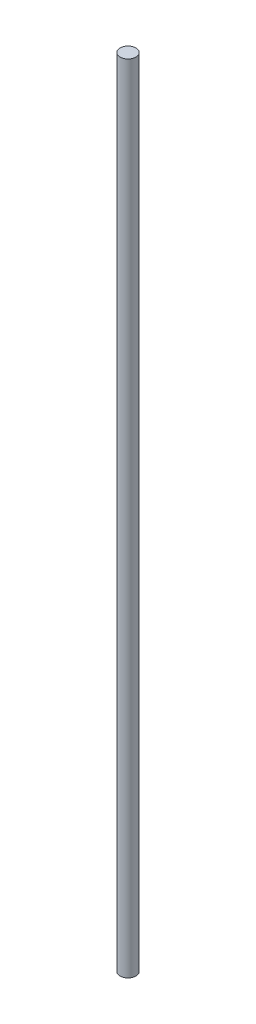
ISO-10303-21;
HEADER;
FILE_DESCRIPTION(('STEP AP214'),'2;1');
FILE_NAME('part.step','',(''),(''),'','','');
FILE_SCHEMA(('AUTOMOTIVE_DESIGN { 1 0 10303 214 1 1 1 1 }'));
ENDSEC;
DATA;
#1=APPLICATION_CONTEXT('core data for automotive mechanical design processes');
#2=APPLICATION_PROTOCOL_DEFINITION('international standard','automotive_design',2000,#1);
#3=PRODUCT_CONTEXT('',#1,'mechanical');
#4=PRODUCT('Part','Part','',(#3));
#5=PRODUCT_RELATED_PRODUCT_CATEGORY('part','',(#4));
#6=PRODUCT_DEFINITION_FORMATION('','',#4);
#7=PRODUCT_DEFINITION_CONTEXT('part definition',#1,'design');
#8=PRODUCT_DEFINITION('design','',#6,#7);
#9=PRODUCT_DEFINITION_SHAPE('','',#8);
#10=(LENGTH_UNIT() NAMED_UNIT(*) SI_UNIT(.MILLI.,.METRE.));
#11=(NAMED_UNIT(*) PLANE_ANGLE_UNIT() SI_UNIT($,.RADIAN.));
#12=(NAMED_UNIT(*) SI_UNIT($,.STERADIAN.) SOLID_ANGLE_UNIT());
#13=UNCERTAINTY_MEASURE_WITH_UNIT(LENGTH_MEASURE(1.E-05),#10,'distance_accuracy_value','');
#14=(GEOMETRIC_REPRESENTATION_CONTEXT(3) GLOBAL_UNCERTAINTY_ASSIGNED_CONTEXT((#13)) GLOBAL_UNIT_ASSIGNED_CONTEXT((#10,
#11,#12)) REPRESENTATION_CONTEXT('',''));
#15=CARTESIAN_POINT('',(0.,0.,0.));
#16=DIRECTION('',(0.,0.,1.));
#17=DIRECTION('',(1.,0.,0.));
#18=AXIS2_PLACEMENT_3D('',#15,#16,#17);
#19=CARTESIAN_POINT('',(0.,400.,0.));
#20=DIRECTION('',(0.,1.,0.));
#21=DIRECTION('',(0.,0.,1.));
#22=AXIS2_PLACEMENT_3D('',#19,#20,#21);
#23=PLANE('',#22);
#24=CARTESIAN_POINT('',(0.,400.,0.));
#25=DIRECTION('',(0.,-1.,0.));
#26=DIRECTION('',(0.,0.,-1.));
#27=AXIS2_PLACEMENT_3D('',#24,#25,#26);
#28=CIRCLE('',#27,4.);
#29=CARTESIAN_POINT('',(0.,400.,-4.));
#30=VERTEX_POINT('',#29);
#31=EDGE_CURVE('E10',#30,#30,#28,.T.);
#32=ORIENTED_EDGE('',*,*,#31,.F.);
#33=EDGE_LOOP('',(#32));
#34=FACE_BOUND('',#33,.T.);
#35=ADVANCED_FACE('F31',(#34),#23,.T.);
#36=CARTESIAN_POINT('',(0.,0.,0.));
#37=DIRECTION('',(0.,-1.,0.));
#38=DIRECTION('',(0.,0.,-1.));
#39=AXIS2_PLACEMENT_3D('',#36,#37,#38);
#40=CYLINDRICAL_SURFACE('',#39,4.);
#41=ORIENTED_EDGE('',*,*,#31,.T.);
#42=EDGE_LOOP('',(#41));
#43=FACE_BOUND('',#42,.T.);
#44=CARTESIAN_POINT('',(0.,0.,0.));
#45=DIRECTION('',(0.,-1.,0.));
#46=DIRECTION('',(0.,0.,-1.));
#47=AXIS2_PLACEMENT_3D('',#44,#45,#46);
#48=CIRCLE('',#47,4.);
#49=CARTESIAN_POINT('',(0.,0.,-4.));
#50=VERTEX_POINT('',#49);
#51=EDGE_CURVE('E37',#50,#50,#48,.T.);
#52=ORIENTED_EDGE('',*,*,#51,.F.);
#53=EDGE_LOOP('',(#52));
#54=FACE_BOUND('',#53,.T.);
#55=ADVANCED_FACE('F45',(#43,#54),#40,.T.);
#56=CARTESIAN_POINT('',(0.,0.,0.));
#57=DIRECTION('',(0.,-1.,0.));
#58=DIRECTION('',(0.,0.,-1.));
#59=AXIS2_PLACEMENT_3D('',#56,#57,#58);
#60=PLANE('',#59);
#61=ORIENTED_EDGE('',*,*,#51,.T.);
#62=EDGE_LOOP('',(#61));
#63=FACE_BOUND('',#62,.T.);
#64=ADVANCED_FACE('F43',(#63),#60,.T.);
#65=CLOSED_SHELL('',(#35,#55,#64));
#66=MANIFOLD_SOLID_BREP('B2',#65);
#67=ADVANCED_BREP_SHAPE_REPRESENTATION('',(#18,#66),#14);
#68=SHAPE_DEFINITION_REPRESENTATION(#9,#67);
ENDSEC;
END-ISO-10303-21;
